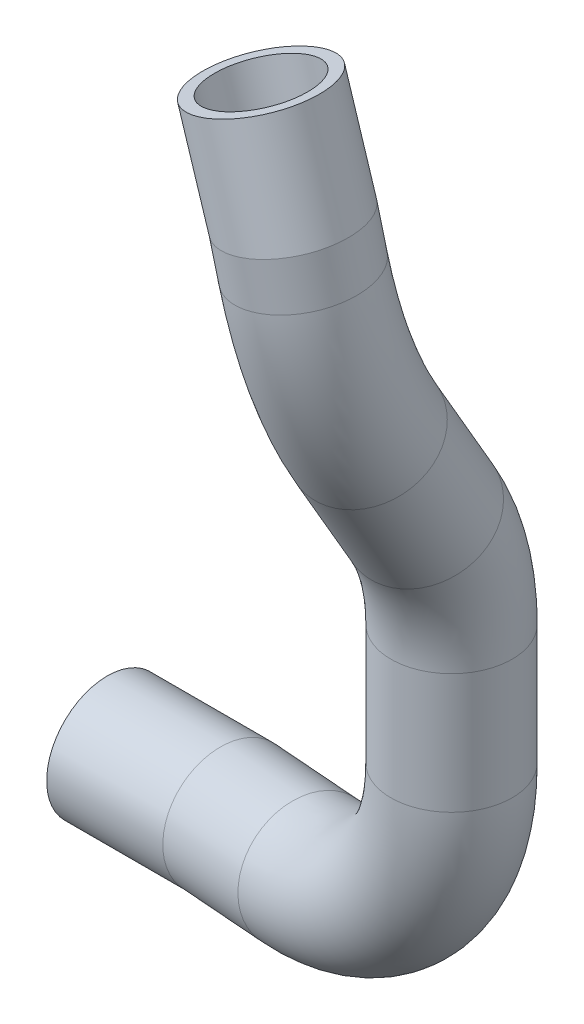
ISO-10303-21;
HEADER;
FILE_DESCRIPTION(('STEP AP214'),'2;1');
FILE_NAME('part.step','',(''),(''),'','','');
FILE_SCHEMA(('AUTOMOTIVE_DESIGN { 1 0 10303 214 1 1 1 1 }'));
ENDSEC;
DATA;
#1=APPLICATION_CONTEXT('core data for automotive mechanical design processes');
#2=APPLICATION_PROTOCOL_DEFINITION('international standard','automotive_design',2000,#1);
#3=PRODUCT_CONTEXT('',#1,'mechanical');
#4=PRODUCT('Part','Part','',(#3));
#5=PRODUCT_RELATED_PRODUCT_CATEGORY('part','',(#4));
#6=PRODUCT_DEFINITION_FORMATION('','',#4);
#7=PRODUCT_DEFINITION_CONTEXT('part definition',#1,'design');
#8=PRODUCT_DEFINITION('design','',#6,#7);
#9=PRODUCT_DEFINITION_SHAPE('','',#8);
#10=(LENGTH_UNIT() NAMED_UNIT(*) SI_UNIT(.MILLI.,.METRE.));
#11=(NAMED_UNIT(*) PLANE_ANGLE_UNIT() SI_UNIT($,.RADIAN.));
#12=(NAMED_UNIT(*) SI_UNIT($,.STERADIAN.) SOLID_ANGLE_UNIT());
#13=UNCERTAINTY_MEASURE_WITH_UNIT(LENGTH_MEASURE(1.E-05),#10,'distance_accuracy_value','');
#14=(GEOMETRIC_REPRESENTATION_CONTEXT(3) GLOBAL_UNCERTAINTY_ASSIGNED_CONTEXT((#13)) GLOBAL_UNIT_ASSIGNED_CONTEXT((#10,
#11,#12)) REPRESENTATION_CONTEXT('',''));
#15=CARTESIAN_POINT('',(0.,0.,0.));
#16=DIRECTION('',(0.,0.,1.));
#17=DIRECTION('',(1.,0.,0.));
#18=AXIS2_PLACEMENT_3D('',#15,#16,#17);
#19=CARTESIAN_POINT('',(1115.98547653986,-333.159402404489,132.564775111162));
#20=DIRECTION('',(0.305631391357894,-0.952138397076841,0.00468245967210421));
#21=DIRECTION('',(0.9521488352697,0.305634741962614,0.));
#22=AXIS2_PLACEMENT_3D('',#19,#20,#21);
#23=PLANE('',#22);
#24=CARTESIAN_POINT('',(1115.98547653986,-333.159402404489,132.564775111162));
#25=DIRECTION('',(0.305631391357894,-0.952138397076841,0.00468245967210421));
#26=DIRECTION('',(0.9521488352697,0.305634741962614,0.));
#27=AXIS2_PLACEMENT_3D('',#24,#25,#26);
#28=CIRCLE('',#27,10.);
#29=CARTESIAN_POINT('',(1125.50696489256,-330.103054984863,132.564775111162));
#30=VERTEX_POINT('',#29);
#31=EDGE_CURVE('E94',#30,#30,#28,.T.);
#32=ORIENTED_EDGE('',*,*,#31,.T.);
#33=EDGE_LOOP('',(#32));
#34=FACE_BOUND('',#33,.T.);
#35=CARTESIAN_POINT('',(1115.98547653986,-333.159402404489,132.564775111162));
#36=DIRECTION('',(0.305631391357894,-0.952138397076841,0.00468245967210421));
#37=DIRECTION('',(0.9521488352697,0.305634741962614,0.));
#38=AXIS2_PLACEMENT_3D('',#35,#36,#37);
#39=CIRCLE('',#38,12.5);
#40=CARTESIAN_POINT('',(1127.88733698073,-329.338968129956,132.564775111162));
#41=VERTEX_POINT('',#40);
#42=EDGE_CURVE('E46',#41,#41,#39,.T.);
#43=ORIENTED_EDGE('',*,*,#42,.F.);
#44=EDGE_LOOP('',(#43));
#45=FACE_BOUND('',#44,.T.);
#46=ADVANCED_FACE('F43',(#34,#45),#23,.F.);
#47=CARTESIAN_POINT('',(1044.70999999994,-507.021686846652,92.9944943392666));
#48=DIRECTION('',(-1.,0.,0.));
#49=DIRECTION('',(0.,-0.976455108790452,-0.215720700251569));
#50=AXIS2_PLACEMENT_3D('',#47,#48,#49);
#51=PLANE('',#50);
#52=CARTESIAN_POINT('',(1044.70999999994,-507.021686846652,92.9944943392666));
#53=DIRECTION('',(-1.,0.,0.));
#54=DIRECTION('',(0.,-1.,0.));
#55=AXIS2_PLACEMENT_3D('',#52,#53,#54);
#56=CIRCLE('',#55,10.);
#57=CARTESIAN_POINT('',(1044.70999999994,-517.021686846652,92.9944943392666));
#58=VERTEX_POINT('',#57);
#59=EDGE_CURVE('E84',#58,#58,#56,.T.);
#60=ORIENTED_EDGE('',*,*,#59,.F.);
#61=EDGE_LOOP('',(#60));
#62=FACE_BOUND('',#61,.T.);
#63=CARTESIAN_POINT('',(1044.70999999994,-507.021686846652,92.9944943392666));
#64=DIRECTION('',(-1.,0.,0.));
#65=DIRECTION('',(0.,-0.976455108790452,-0.215720700251569));
#66=AXIS2_PLACEMENT_3D('',#63,#64,#65);
#67=CIRCLE('',#66,12.5);
#68=CARTESIAN_POINT('',(1044.70999999994,-519.227375706533,90.297985586122));
#69=VERTEX_POINT('',#68);
#70=EDGE_CURVE('E50',#69,#69,#67,.T.);
#71=ORIENTED_EDGE('',*,*,#70,.T.);
#72=EDGE_LOOP('',(#71));
#73=FACE_BOUND('',#72,.T.);
#74=ADVANCED_FACE('F178',(#62,#73),#51,.T.);
#75=CARTESIAN_POINT('',(1123.30869845987,-355.973553625603,132.676971345841));
#76=DIRECTION('',(-0.305631391357895,0.952138397076841,-0.00468245967210422));
#77=DIRECTION('',(-0.9521488352697,-0.305634741962615,0.));
#78=AXIS2_PLACEMENT_3D('',#75,#76,#77);
#79=CYLINDRICAL_SURFACE('',#78,12.5);
#80=CARTESIAN_POINT('',(1122.66267373503,-353.960982393138,132.667073852302));
#81=DIRECTION('',(-0.237563859944987,0.970808967962248,0.0330659972194067));
#82=DIRECTION('',(0.860594486855297,0.194562735485905,0.47066173750849));
#83=AXIS2_PLACEMENT_3D('',#80,#81,#82);
#84=ELLIPSE('',#83,12.5401707129033,12.5);
#85=CARTESIAN_POINT('',(1133.45467551478,-351.521132475776,138.569252388691));
#86=VERTEX_POINT('',#85);
#87=EDGE_CURVE('E63',#86,#86,#84,.T.);
#88=ORIENTED_EDGE('',*,*,#87,.T.);
#89=EDGE_LOOP('',(#88));
#90=FACE_BOUND('',#89,.T.);
#91=ORIENTED_EDGE('',*,*,#42,.T.);
#92=EDGE_LOOP('',(#91));
#93=FACE_BOUND('',#92,.T.);
#94=ADVANCED_FACE('F158',(#90,#93),#79,.T.);
#95=CARTESIAN_POINT('',(1066.8090480782,-507.309915520103,92.5059935092377));
#96=DIRECTION('',(0.981417109873512,0.0975102515701626,0.165264053218616));
#97=DIRECTION('',(0.166055386756409,0.,-0.986116427471513));
#98=AXIS2_PLACEMENT_3D('',#95,#96,#97);
#99=CYLINDRICAL_SURFACE('',#98,12.5);
#100=CARTESIAN_POINT('',(1069.70999999994,-507.021686846652,92.9944943392666));
#101=DIRECTION('',(0.995343435672711,0.048983219296694,0.0830186080982797));
#102=DIRECTION('',(0.09639214212395,-0.505799795613915,-0.857248576373084));
#103=AXIS2_PLACEMENT_3D('',#100,#101,#102);
#104=ELLIPSE('',#103,12.5584793670255,12.5);
#105=CARTESIAN_POINT('',(1070.92053872794,-513.373763143715,82.2287557804733));
#106=VERTEX_POINT('',#105);
#107=EDGE_CURVE('E11',#106,#106,#104,.T.);
#108=ORIENTED_EDGE('',*,*,#107,.T.);
#109=EDGE_LOOP('',(#108));
#110=FACE_BOUND('',#109,.T.);
#111=CARTESIAN_POINT('',(1089.39229483507,-505.066121265469,96.3088606656471));
#112=DIRECTION('',(-0.981417109873513,-0.0975102515701618,-0.165264053218616));
#113=DIRECTION('',(0.130865260591859,-0.970014917869257,-0.204805621703417));
#114=AXIS2_PLACEMENT_3D('',#111,#112,#113);
#115=CIRCLE('',#114,12.5);
#116=CARTESIAN_POINT('',(1090.59425059657,-517.506552771995,96.511261947362));
#117=VERTEX_POINT('',#116);
#118=EDGE_CURVE('E59',#117,#117,#115,.T.);
#119=ORIENTED_EDGE('',*,*,#118,.T.);
#120=EDGE_LOOP('',(#119));
#121=FACE_BOUND('',#120,.T.);
#122=ADVANCED_FACE('F154',(#110,#121),#99,.T.);
#123=CARTESIAN_POINT('',(1085.54603639826,-465.256740444588,95.6611765641591));
#124=DIRECTION('',(-0.166055386756409,0.,0.986116427471513));
#125=DIRECTION('',(0.986116427471513,0.,0.166055386756409));
#126=AXIS2_PLACEMENT_3D('',#123,#124,#125);
#127=TOROIDAL_SURFACE('',#126,39.9999999999997,12.5);
#128=CARTESIAN_POINT('',(1124.99069349712,-465.256740444589,102.303392034415));
#129=DIRECTION('',(0.,-1.,0.));
#130=DIRECTION('',(0.99827331975802,0.,-0.058739927300793));
#131=AXIS2_PLACEMENT_3D('',#128,#129,#130);
#132=CIRCLE('',#131,12.5);
#133=CARTESIAN_POINT('',(1137.31714884052,-465.256740444589,104.379084368871));
#134=VERTEX_POINT('',#133);
#135=EDGE_CURVE('E62',#134,#134,#132,.T.);
#136=CARTESIAN_POINT('',(1085.54603639826,-465.256740444588,95.6611765641591));
#137=DIRECTION('',(-0.166055386756409,0.,0.986116427471513));
#138=DIRECTION('',(0.986116427471513,0.,0.166055386756409));
#139=AXIS2_PLACEMENT_3D('',#136,#137,#138);
#140=CIRCLE('',#139,52.4999999999997);
#141=EDGE_CURVE('',#117,#134,#140,.T.);
#142=ORIENTED_EDGE('',*,*,#118,.F.);
#143=ORIENTED_EDGE('',*,*,#135,.T.);
#144=ORIENTED_EDGE('',*,*,#141,.T.);
#145=ORIENTED_EDGE('',*,*,#141,.F.);
#146=EDGE_LOOP('',(#142,#144,#143,#145));
#147=FACE_BOUND('',#146,.T.);
#148=ADVANCED_FACE('F157',(#147),#127,.T.);
#149=CARTESIAN_POINT('',(1124.99069349712,-465.256740444589,102.303392034415));
#150=DIRECTION('',(0.,1.,0.));
#151=DIRECTION('',(0.,0.,1.));
#152=AXIS2_PLACEMENT_3D('',#149,#150,#151);
#153=CYLINDRICAL_SURFACE('',#152,12.5);
#154=CARTESIAN_POINT('',(1124.99069349712,-440.504638353155,102.303392034415));
#155=DIRECTION('',(0.,-1.,0.));
#156=DIRECTION('',(0.99827331975802,0.,-0.058739927300793));
#157=AXIS2_PLACEMENT_3D('',#154,#155,#156);
#158=CIRCLE('',#157,12.5);
#159=CARTESIAN_POINT('',(1124.01368908879,-440.504638353155,89.841632030865));
#160=VERTEX_POINT('',#159);
#161=EDGE_CURVE('E66',#160,#160,#158,.T.);
#162=ORIENTED_EDGE('',*,*,#161,.T.);
#163=EDGE_LOOP('',(#162));
#164=FACE_BOUND('',#163,.T.);
#165=ORIENTED_EDGE('',*,*,#135,.F.);
#166=EDGE_LOOP('',(#165));
#167=FACE_BOUND('',#166,.T.);
#168=ADVANCED_FACE('F161',(#164,#167),#153,.T.);
#169=CARTESIAN_POINT('',(1128.50790936714,-440.504638353155,147.165728047197));
#170=DIRECTION('',(0.996940800284035,0.,-0.0781603526669906));
#171=DIRECTION('',(-0.0781603526669906,0.,-0.996940800284035));
#172=AXIS2_PLACEMENT_3D('',#169,#170,#171);
#173=TOROIDAL_SURFACE('',#172,45.0000000000001,12.5);
#174=CARTESIAN_POINT('',(1125.4954452056,-417.277359239227,108.741535607548));
#175=DIRECTION('',(-0.0403433850453168,-0.856491120495854,-0.514582716183552));
#176=DIRECTION('',(0.998054984756088,-0.0100471735805981,-0.0615248056198938));
#177=AXIS2_PLACEMENT_3D('',#174,#175,#176);
#178=CIRCLE('',#177,12.5);
#179=CARTESIAN_POINT('',(1124.65864960518,-410.825337263136,98.0681488187568));
#180=VERTEX_POINT('',#179);
#181=EDGE_CURVE('E69',#180,#180,#178,.T.);
#182=CARTESIAN_POINT('',(1128.50790936714,-440.504638353155,147.165728047197));
#183=DIRECTION('',(0.996940800284035,0.,-0.0781603526669906));
#184=DIRECTION('',(-0.0781603526669906,0.,-0.996940800284035));
#185=AXIS2_PLACEMENT_3D('',#182,#183,#184);
#186=CIRCLE('',#185,57.5000000000001);
#187=EDGE_CURVE('',#160,#180,#186,.T.);
#188=ORIENTED_EDGE('',*,*,#161,.F.);
#189=ORIENTED_EDGE('',*,*,#181,.T.);
#190=ORIENTED_EDGE('',*,*,#187,.T.);
#191=ORIENTED_EDGE('',*,*,#187,.F.);
#192=EDGE_LOOP('',(#188,#190,#189,#191));
#193=FACE_BOUND('',#192,.T.);
#194=ADVANCED_FACE('F165',(#193),#173,.T.);
#195=CARTESIAN_POINT('',(1125.4954452056,-417.277359239227,108.741535607548));
#196=DIRECTION('',(0.0403433850453129,0.856491120495854,0.514582716183552));
#197=DIRECTION('',(0.,-0.515001992571554,0.857188980124762));
#198=AXIS2_PLACEMENT_3D('',#195,#196,#197);
#199=CYLINDRICAL_SURFACE('',#198,12.5);
#200=CARTESIAN_POINT('',(1126.48164830594,-396.340241605401,121.320625575032));
#201=DIRECTION('',(-0.0403433850453137,-0.856491120495854,-0.514582716183552));
#202=DIRECTION('',(0.998054984756089,-0.0100471735805953,-0.0615248056198922));
#203=AXIS2_PLACEMENT_3D('',#200,#201,#202);
#204=CIRCLE('',#203,12.5);
#205=CARTESIAN_POINT('',(1131.66356096837,-402.376906663456,130.962018427508));
#206=VERTEX_POINT('',#205);
#207=EDGE_CURVE('E72',#206,#206,#204,.T.);
#208=ORIENTED_EDGE('',*,*,#207,.T.);
#209=EDGE_LOOP('',(#208));
#210=FACE_BOUND('',#209,.T.);
#211=ORIENTED_EDGE('',*,*,#181,.F.);
#212=EDGE_LOOP('',(#211));
#213=FACE_BOUND('',#212,.T.);
#214=ADVANCED_FACE('F169',(#210,#213),#199,.T.);
#215=CARTESIAN_POINT('',(1097.46293739631,-362.534917280294,67.3288256011664));
#216=DIRECTION('',(-0.909130469569774,-0.182204501491204,0.374544134830841));
#217=DIRECTION('',(0.380920493623076,0.,0.924607796602404));
#218=AXIS2_PLACEMENT_3D('',#215,#216,#217);
#219=TOROIDAL_SURFACE('',#218,70.,12.5);
#220=CARTESIAN_POINT('',(1124.14261955836,-362.624040315449,132.045026175802));
#221=DIRECTION('',(0.167974322200153,-0.983259832716256,-0.0706026093582887));
#222=DIRECTION('',(0.985653319705051,0.168718066318747,-0.00466341635227635));
#223=AXIS2_PLACEMENT_3D('',#220,#221,#222);
#224=CIRCLE('',#223,12.5);
#225=CARTESIAN_POINT('',(1128.90684851587,-362.639955143155,143.60149056413));
#226=VERTEX_POINT('',#225);
#227=EDGE_CURVE('E55',#226,#226,#224,.T.);
#228=CARTESIAN_POINT('',(1097.46293739631,-362.534917280294,67.3288256011664));
#229=DIRECTION('',(-0.909130469569774,-0.182204501491204,0.374544134830841));
#230=DIRECTION('',(0.380920493623076,0.,0.924607796602404));
#231=AXIS2_PLACEMENT_3D('',#228,#229,#230);
#232=CIRCLE('',#231,82.4999999999999);
#233=EDGE_CURVE('',#206,#226,#232,.T.);
#234=ORIENTED_EDGE('',*,*,#207,.F.);
#235=ORIENTED_EDGE('',*,*,#227,.T.);
#236=ORIENTED_EDGE('',*,*,#233,.T.);
#237=ORIENTED_EDGE('',*,*,#233,.F.);
#238=EDGE_LOOP('',(#234,#236,#235,#237));
#239=FACE_BOUND('',#238,.T.);
#240=ADVANCED_FACE('F145',(#239),#219,.T.);
#241=CARTESIAN_POINT('',(1124.14261955836,-362.624040315449,132.045026175802));
#242=DIRECTION('',(-0.167974322200182,0.98325983271625,0.0706026093583107));
#243=DIRECTION('',(-0.985719674408062,-0.168394547075799,0.));
#244=AXIS2_PLACEMENT_3D('',#241,#242,#243);
#245=CYLINDRICAL_SURFACE('',#244,12.5);
#246=ORIENTED_EDGE('',*,*,#227,.F.);
#247=EDGE_LOOP('',(#246));
#248=FACE_BOUND('',#247,.T.);
#249=ORIENTED_EDGE('',*,*,#87,.F.);
#250=EDGE_LOOP('',(#249));
#251=FACE_BOUND('',#250,.T.);
#252=ADVANCED_FACE('F139',(#248,#251),#245,.T.);
#253=CARTESIAN_POINT('',(1044.70999999994,-507.021686846652,92.9944943392666));
#254=DIRECTION('',(1.,0.,0.));
#255=DIRECTION('',(0.,0.,-1.));
#256=AXIS2_PLACEMENT_3D('',#253,#254,#255);
#257=CYLINDRICAL_SURFACE('',#256,12.5);
#258=ORIENTED_EDGE('',*,*,#70,.F.);
#259=EDGE_LOOP('',(#258));
#260=FACE_BOUND('',#259,.T.);
#261=ORIENTED_EDGE('',*,*,#107,.F.);
#262=EDGE_LOOP('',(#261));
#263=FACE_BOUND('',#262,.T.);
#264=ADVANCED_FACE('F135',(#260,#263),#257,.T.);
#265=CARTESIAN_POINT('',(1123.30869845987,-355.973553625603,132.676971345841));
#266=DIRECTION('',(-0.305631391357895,0.952138397076841,-0.00468245967210422));
#267=DIRECTION('',(-0.9521488352697,-0.305634741962615,0.));
#268=AXIS2_PLACEMENT_3D('',#265,#266,#267);
#269=CYLINDRICAL_SURFACE('',#268,10.);
#270=CARTESIAN_POINT('',(1122.66267373503,-353.960982393137,132.667073852302));
#271=DIRECTION('',(-0.237563859944987,0.970808967962248,0.0330659972194067));
#272=DIRECTION('',(-0.860594486855297,-0.194562735485904,-0.47066173750849));
#273=AXIS2_PLACEMENT_3D('',#270,#271,#272);
#274=ELLIPSE('',#273,10.0321365703226,10.);
#275=CARTESIAN_POINT('',(1114.02907231123,-355.912862327027,127.945331023192));
#276=VERTEX_POINT('',#275);
#277=EDGE_CURVE('E96',#276,#276,#274,.T.);
#278=ORIENTED_EDGE('',*,*,#277,.F.);
#279=EDGE_LOOP('',(#278));
#280=FACE_BOUND('',#279,.T.);
#281=ORIENTED_EDGE('',*,*,#31,.F.);
#282=EDGE_LOOP('',(#281));
#283=FACE_BOUND('',#282,.T.);
#284=ADVANCED_FACE('F129',(#280,#283),#269,.F.);
#285=CARTESIAN_POINT('',(1066.8090480782,-507.309915520103,92.5059935092377));
#286=DIRECTION('',(0.981417109873512,0.0975102515701626,0.165264053218616));
#287=DIRECTION('',(0.166055386756409,0.,-0.986116427471513));
#288=AXIS2_PLACEMENT_3D('',#285,#286,#287);
#289=CYLINDRICAL_SURFACE('',#288,10.);
#290=CARTESIAN_POINT('',(1069.70999999994,-507.021686846652,92.9944943392666));
#291=DIRECTION('',(0.995343435672711,0.048983219296694,0.0830186080982797));
#292=DIRECTION('',(-0.0963921421239504,0.505799795613914,0.857248576373084));
#293=AXIS2_PLACEMENT_3D('',#290,#291,#292);
#294=ELLIPSE('',#293,10.0467834936204,10.);
#295=CARTESIAN_POINT('',(1068.74156901753,-501.940025809002,101.607085186301));
#296=VERTEX_POINT('',#295);
#297=EDGE_CURVE('E80',#296,#296,#294,.T.);
#298=ORIENTED_EDGE('',*,*,#297,.F.);
#299=EDGE_LOOP('',(#298));
#300=FACE_BOUND('',#299,.T.);
#301=CARTESIAN_POINT('',(1089.39229483507,-505.066121265469,96.3088606656471));
#302=DIRECTION('',(0.981417109873512,0.0975102515701626,0.165264053218616));
#303=DIRECTION('',(0.166055386756409,0.,-0.986116427471513));
#304=AXIS2_PLACEMENT_3D('',#301,#302,#303);
#305=CIRCLE('',#304,10.);
#306=CARTESIAN_POINT('',(1090.35385944427,-515.01846647069,96.4707816910191));
#307=VERTEX_POINT('',#306);
#308=EDGE_CURVE('E92',#307,#307,#305,.F.);
#309=ORIENTED_EDGE('',*,*,#308,.F.);
#310=EDGE_LOOP('',(#309));
#311=FACE_BOUND('',#310,.T.);
#312=ADVANCED_FACE('F124',(#300,#311),#289,.F.);
#313=CARTESIAN_POINT('',(1085.54603639826,-465.256740444588,95.6611765641591));
#314=DIRECTION('',(-0.166055386756409,0.,0.986116427471513));
#315=DIRECTION('',(0.986116427471513,0.,0.166055386756409));
#316=AXIS2_PLACEMENT_3D('',#313,#314,#315);
#317=TOROIDAL_SURFACE('',#316,39.9999999999997,10.);
#318=CARTESIAN_POINT('',(1124.99069349712,-465.256740444589,102.303392034415));
#319=DIRECTION('',(0.,-1.,0.));
#320=DIRECTION('',(1.,0.,0.));
#321=AXIS2_PLACEMENT_3D('',#318,#319,#320);
#322=CIRCLE('',#321,10.);
#323=CARTESIAN_POINT('',(1134.85185777184,-465.256740444589,103.96394590198));
#324=VERTEX_POINT('',#323);
#325=EDGE_CURVE('E104',#324,#324,#322,.T.);
#326=CARTESIAN_POINT('',(1085.54603639826,-465.256740444588,95.6611765641591));
#327=DIRECTION('',(-0.166055386756409,0.,0.986116427471513));
#328=DIRECTION('',(0.986116427471513,0.,0.166055386756409));
#329=AXIS2_PLACEMENT_3D('',#326,#327,#328);
#330=CIRCLE('',#329,49.9999999999997);
#331=EDGE_CURVE('',#307,#324,#330,.T.);
#332=ORIENTED_EDGE('',*,*,#308,.T.);
#333=ORIENTED_EDGE('',*,*,#325,.F.);
#334=ORIENTED_EDGE('',*,*,#331,.T.);
#335=ORIENTED_EDGE('',*,*,#331,.F.);
#336=EDGE_LOOP('',(#332,#334,#333,#335));
#337=FACE_BOUND('',#336,.T.);
#338=ADVANCED_FACE('F121',(#337),#317,.F.);
#339=CARTESIAN_POINT('',(1124.99069349712,-465.256740444589,102.303392034415));
#340=DIRECTION('',(0.,1.,0.));
#341=DIRECTION('',(0.,0.,1.));
#342=AXIS2_PLACEMENT_3D('',#339,#340,#341);
#343=CYLINDRICAL_SURFACE('',#342,10.);
#344=CARTESIAN_POINT('',(1124.99069349712,-440.504638353155,102.303392034415));
#345=DIRECTION('',(0.,1.,0.));
#346=DIRECTION('',(0.,0.,1.));
#347=AXIS2_PLACEMENT_3D('',#344,#345,#346);
#348=CIRCLE('',#347,10.);
#349=CARTESIAN_POINT('',(1124.20908997045,-440.504638353155,92.3339840315751));
#350=VERTEX_POINT('',#349);
#351=EDGE_CURVE('E114',#350,#350,#348,.F.);
#352=ORIENTED_EDGE('',*,*,#351,.F.);
#353=EDGE_LOOP('',(#352));
#354=FACE_BOUND('',#353,.T.);
#355=ORIENTED_EDGE('',*,*,#325,.T.);
#356=EDGE_LOOP('',(#355));
#357=FACE_BOUND('',#356,.T.);
#358=ADVANCED_FACE('F119',(#354,#357),#343,.F.);
#359=CARTESIAN_POINT('',(1128.50790936714,-440.504638353155,147.165728047197));
#360=DIRECTION('',(0.996940800284035,0.,-0.0781603526669906));
#361=DIRECTION('',(-0.0781603526669906,0.,-0.996940800284035));
#362=AXIS2_PLACEMENT_3D('',#359,#360,#361);
#363=TOROIDAL_SURFACE('',#362,45.0000000000001,10.);
#364=CARTESIAN_POINT('',(1125.4954452056,-417.277359239227,108.741535607548));
#365=DIRECTION('',(-0.0403433850453157,-0.856491120495857,-0.514582716183548));
#366=DIRECTION('',(0.,0.51500199257155,-0.857188980124764));
#367=AXIS2_PLACEMENT_3D('',#364,#365,#366);
#368=CIRCLE('',#367,10.);
#369=CARTESIAN_POINT('',(1124.82600872526,-412.115741658354,100.202826176515));
#370=VERTEX_POINT('',#369);
#371=EDGE_CURVE('E111',#370,#370,#368,.T.);
#372=CARTESIAN_POINT('',(1128.50790936714,-440.504638353155,147.165728047197));
#373=DIRECTION('',(0.996940800284035,0.,-0.0781603526669906));
#374=DIRECTION('',(-0.0781603526669906,0.,-0.996940800284035));
#375=AXIS2_PLACEMENT_3D('',#372,#373,#374);
#376=CIRCLE('',#375,55.0000000000001);
#377=EDGE_CURVE('',#350,#370,#376,.T.);
#378=ORIENTED_EDGE('',*,*,#351,.T.);
#379=ORIENTED_EDGE('',*,*,#371,.F.);
#380=ORIENTED_EDGE('',*,*,#377,.T.);
#381=ORIENTED_EDGE('',*,*,#377,.F.);
#382=EDGE_LOOP('',(#378,#380,#379,#381));
#383=FACE_BOUND('',#382,.T.);
#384=ADVANCED_FACE('F203',(#383),#363,.F.);
#385=CARTESIAN_POINT('',(1125.4954452056,-417.277359239227,108.741535607548));
#386=DIRECTION('',(0.0403433850453129,0.856491120495854,0.514582716183552));
#387=DIRECTION('',(0.,-0.515001992571554,0.857188980124762));
#388=AXIS2_PLACEMENT_3D('',#385,#386,#387);
#389=CYLINDRICAL_SURFACE('',#388,10.);
#390=CARTESIAN_POINT('',(1126.48164830594,-396.340241605401,121.320625575032));
#391=DIRECTION('',(0.0403433850453129,0.856491120495854,0.514582716183552));
#392=DIRECTION('',(0.,-0.515001992571554,0.857188980124762));
#393=AXIS2_PLACEMENT_3D('',#390,#391,#392);
#394=CIRCLE('',#393,10.);
#395=CARTESIAN_POINT('',(1130.62717843588,-401.169573651845,129.033739857013));
#396=VERTEX_POINT('',#395);
#397=EDGE_CURVE('E108',#396,#396,#394,.F.);
#398=ORIENTED_EDGE('',*,*,#397,.F.);
#399=EDGE_LOOP('',(#398));
#400=FACE_BOUND('',#399,.T.);
#401=ORIENTED_EDGE('',*,*,#371,.T.);
#402=EDGE_LOOP('',(#401));
#403=FACE_BOUND('',#402,.T.);
#404=ADVANCED_FACE('F197',(#400,#403),#389,.F.);
#405=CARTESIAN_POINT('',(1097.46293739631,-362.534917280294,67.3288256011664));
#406=DIRECTION('',(-0.909130469569774,-0.182204501491204,0.374544134830841));
#407=DIRECTION('',(0.380920493623076,0.,0.924607796602404));
#408=AXIS2_PLACEMENT_3D('',#405,#406,#407);
#409=TOROIDAL_SURFACE('',#408,70.,10.);
#410=CARTESIAN_POINT('',(1124.14261955836,-362.624040315449,132.045026175802));
#411=DIRECTION('',(0.167974322200153,-0.983259832716256,-0.0706026093582903));
#412=DIRECTION('',(0.985719674408068,0.168394547075769,0.));
#413=AXIS2_PLACEMENT_3D('',#410,#411,#412);
#414=CIRCLE('',#413,10.);
#415=CARTESIAN_POINT('',(1127.95400272437,-362.636772177614,141.290197686465));
#416=VERTEX_POINT('',#415);
#417=EDGE_CURVE('E89',#416,#416,#414,.T.);
#418=CARTESIAN_POINT('',(1097.46293739631,-362.534917280294,67.3288256011664));
#419=DIRECTION('',(-0.909130469569774,-0.182204501491204,0.374544134830841));
#420=DIRECTION('',(0.380920493623076,0.,0.924607796602404));
#421=AXIS2_PLACEMENT_3D('',#418,#419,#420);
#422=CIRCLE('',#421,79.9999999999999);
#423=EDGE_CURVE('',#396,#416,#422,.T.);
#424=ORIENTED_EDGE('',*,*,#397,.T.);
#425=ORIENTED_EDGE('',*,*,#417,.F.);
#426=ORIENTED_EDGE('',*,*,#423,.T.);
#427=ORIENTED_EDGE('',*,*,#423,.F.);
#428=EDGE_LOOP('',(#424,#426,#425,#427));
#429=FACE_BOUND('',#428,.T.);
#430=ADVANCED_FACE('F192',(#429),#409,.F.);
#431=CARTESIAN_POINT('',(1124.14261955836,-362.624040315449,132.045026175802));
#432=DIRECTION('',(-0.167974322200182,0.98325983271625,0.0706026093583107));
#433=DIRECTION('',(-0.985719674408062,-0.168394547075799,0.));
#434=AXIS2_PLACEMENT_3D('',#431,#432,#433);
#435=CYLINDRICAL_SURFACE('',#434,10.);
#436=ORIENTED_EDGE('',*,*,#417,.T.);
#437=EDGE_LOOP('',(#436));
#438=FACE_BOUND('',#437,.T.);
#439=ORIENTED_EDGE('',*,*,#277,.T.);
#440=EDGE_LOOP('',(#439));
#441=FACE_BOUND('',#440,.T.);
#442=ADVANCED_FACE('F188',(#438,#441),#435,.F.);
#443=CARTESIAN_POINT('',(1044.70999999994,-507.021686846652,92.9944943392666));
#444=DIRECTION('',(1.,0.,0.));
#445=DIRECTION('',(0.,0.,-1.));
#446=AXIS2_PLACEMENT_3D('',#443,#444,#445);
#447=CYLINDRICAL_SURFACE('',#446,10.);
#448=ORIENTED_EDGE('',*,*,#59,.T.);
#449=EDGE_LOOP('',(#448));
#450=FACE_BOUND('',#449,.T.);
#451=ORIENTED_EDGE('',*,*,#297,.T.);
#452=EDGE_LOOP('',(#451));
#453=FACE_BOUND('',#452,.T.);
#454=ADVANCED_FACE('F152',(#450,#453),#447,.F.);
#455=CLOSED_SHELL('',(#46,#74,#94,#122,#148,#168,#194,#214,#240,#252,#264,#284,#312,#338,#358,
#384,#404,#430,#442,#454));
#456=MANIFOLD_SOLID_BREP('B2',#455);
#457=ADVANCED_BREP_SHAPE_REPRESENTATION('',(#18,#456),#14);
#458=SHAPE_DEFINITION_REPRESENTATION(#9,#457);
ENDSEC;
END-ISO-10303-21;
